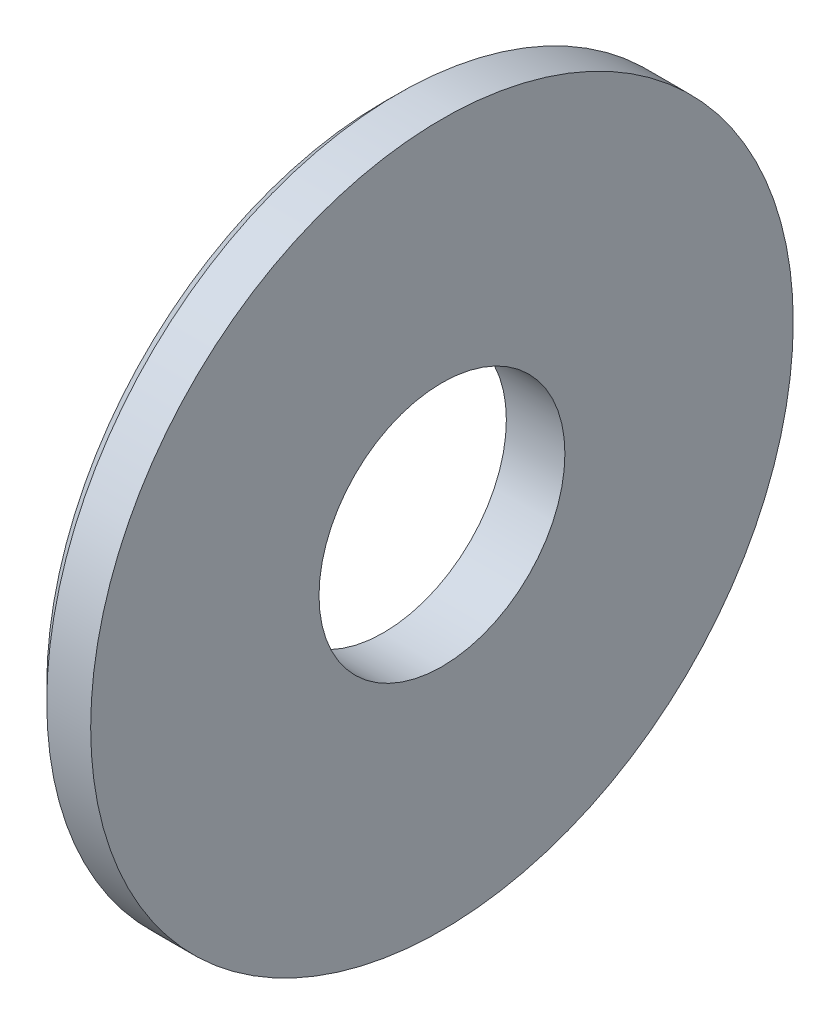
ISO-10303-21;
HEADER;
FILE_DESCRIPTION(('STEP AP214'),'2;1');
FILE_NAME('part.step','',(''),(''),'','','');
FILE_SCHEMA(('AUTOMOTIVE_DESIGN { 1 0 10303 214 1 1 1 1 }'));
ENDSEC;
DATA;
#1=APPLICATION_CONTEXT('core data for automotive mechanical design processes');
#2=APPLICATION_PROTOCOL_DEFINITION('international standard','automotive_design',2000,#1);
#3=PRODUCT_CONTEXT('',#1,'mechanical');
#4=PRODUCT('Part','Part','',(#3));
#5=PRODUCT_RELATED_PRODUCT_CATEGORY('part','',(#4));
#6=PRODUCT_DEFINITION_FORMATION('','',#4);
#7=PRODUCT_DEFINITION_CONTEXT('part definition',#1,'design');
#8=PRODUCT_DEFINITION('design','',#6,#7);
#9=PRODUCT_DEFINITION_SHAPE('','',#8);
#10=(LENGTH_UNIT() NAMED_UNIT(*) SI_UNIT(.MILLI.,.METRE.));
#11=(NAMED_UNIT(*) PLANE_ANGLE_UNIT() SI_UNIT($,.RADIAN.));
#12=(NAMED_UNIT(*) SI_UNIT($,.STERADIAN.) SOLID_ANGLE_UNIT());
#13=UNCERTAINTY_MEASURE_WITH_UNIT(LENGTH_MEASURE(1.E-05),#10,'distance_accuracy_value','');
#14=(GEOMETRIC_REPRESENTATION_CONTEXT(3) GLOBAL_UNCERTAINTY_ASSIGNED_CONTEXT((#13)) GLOBAL_UNIT_ASSIGNED_CONTEXT((#10,
#11,#12)) REPRESENTATION_CONTEXT('',''));
#15=CARTESIAN_POINT('',(0.,0.,0.));
#16=DIRECTION('',(0.,0.,1.));
#17=DIRECTION('',(1.,0.,0.));
#18=AXIS2_PLACEMENT_3D('',#15,#16,#17);
#19=CARTESIAN_POINT('',(2.,0.,0.));
#20=DIRECTION('',(-1.,0.,0.));
#21=DIRECTION('',(0.,0.,1.));
#22=AXIS2_PLACEMENT_3D('',#19,#20,#21);
#23=CYLINDRICAL_SURFACE('',#22,4.2);
#24=CARTESIAN_POINT('',(0.,0.,0.));
#25=DIRECTION('',(-1.,0.,0.));
#26=DIRECTION('',(0.,0.,1.));
#27=AXIS2_PLACEMENT_3D('',#24,#25,#26);
#28=CIRCLE('',#27,4.2);
#29=CARTESIAN_POINT('',(0.,0.,4.2));
#30=VERTEX_POINT('',#29);
#31=EDGE_CURVE('E43',#30,#30,#28,.T.);
#32=ORIENTED_EDGE('',*,*,#31,.T.);
#33=EDGE_LOOP('',(#32));
#34=FACE_BOUND('',#33,.T.);
#35=CARTESIAN_POINT('',(2.,0.,0.));
#36=DIRECTION('',(-1.,0.,0.));
#37=DIRECTION('',(0.,0.,1.));
#38=AXIS2_PLACEMENT_3D('',#35,#36,#37);
#39=CIRCLE('',#38,4.2);
#40=CARTESIAN_POINT('',(2.,0.,4.2));
#41=VERTEX_POINT('',#40);
#42=EDGE_CURVE('E52',#41,#41,#39,.T.);
#43=ORIENTED_EDGE('',*,*,#42,.F.);
#44=EDGE_LOOP('',(#43));
#45=FACE_BOUND('',#44,.T.);
#46=ADVANCED_FACE('F32',(#34,#45),#23,.F.);
#47=CARTESIAN_POINT('',(0.,4.2,0.));
#48=DIRECTION('',(-1.,0.,0.));
#49=DIRECTION('',(0.,0.,1.));
#50=AXIS2_PLACEMENT_3D('',#47,#48,#49);
#51=PLANE('',#50);
#52=CARTESIAN_POINT('',(0.,0.,0.));
#53=DIRECTION('',(-1.,0.,0.));
#54=DIRECTION('',(0.,0.,1.));
#55=AXIS2_PLACEMENT_3D('',#52,#53,#54);
#56=CIRCLE('',#55,11.5);
#57=CARTESIAN_POINT('',(0.,0.,11.5));
#58=VERTEX_POINT('',#57);
#59=EDGE_CURVE('E39',#58,#58,#56,.T.);
#60=ORIENTED_EDGE('',*,*,#59,.T.);
#61=EDGE_LOOP('',(#60));
#62=FACE_BOUND('',#61,.T.);
#63=ORIENTED_EDGE('',*,*,#31,.F.);
#64=EDGE_LOOP('',(#63));
#65=FACE_BOUND('',#64,.T.);
#66=ADVANCED_FACE('F60',(#62,#65),#51,.T.);
#67=CARTESIAN_POINT('',(2.,0.,0.));
#68=DIRECTION('',(-1.,0.,0.));
#69=DIRECTION('',(0.,0.,1.));
#70=AXIS2_PLACEMENT_3D('',#67,#68,#69);
#71=CYLINDRICAL_SURFACE('',#70,12.);
#72=CARTESIAN_POINT('',(0.500000000000006,0.,0.));
#73=DIRECTION('',(-1.,0.,0.));
#74=DIRECTION('',(0.,0.,1.));
#75=AXIS2_PLACEMENT_3D('',#72,#73,#74);
#76=CIRCLE('',#75,12.);
#77=CARTESIAN_POINT('',(0.500000000000006,0.,12.));
#78=VERTEX_POINT('',#77);
#79=EDGE_CURVE('E10',#78,#78,#76,.F.);
#80=ORIENTED_EDGE('',*,*,#79,.T.);
#81=EDGE_LOOP('',(#80));
#82=FACE_BOUND('',#81,.T.);
#83=CARTESIAN_POINT('',(2.,0.,0.));
#84=DIRECTION('',(-1.,0.,0.));
#85=DIRECTION('',(0.,0.,1.));
#86=AXIS2_PLACEMENT_3D('',#83,#84,#85);
#87=CIRCLE('',#86,12.);
#88=CARTESIAN_POINT('',(2.,0.,12.));
#89=VERTEX_POINT('',#88);
#90=EDGE_CURVE('E47',#89,#89,#87,.T.);
#91=ORIENTED_EDGE('',*,*,#90,.T.);
#92=EDGE_LOOP('',(#91));
#93=FACE_BOUND('',#92,.T.);
#94=ADVANCED_FACE('F65',(#82,#93),#71,.T.);
#95=CARTESIAN_POINT('',(2.,12.,0.));
#96=DIRECTION('',(1.,0.,0.));
#97=DIRECTION('',(0.,0.,-1.));
#98=AXIS2_PLACEMENT_3D('',#95,#96,#97);
#99=PLANE('',#98);
#100=ORIENTED_EDGE('',*,*,#42,.T.);
#101=EDGE_LOOP('',(#100));
#102=FACE_BOUND('',#101,.T.);
#103=ORIENTED_EDGE('',*,*,#90,.F.);
#104=EDGE_LOOP('',(#103));
#105=FACE_BOUND('',#104,.T.);
#106=ADVANCED_FACE('F56',(#102,#105),#99,.T.);
#107=CARTESIAN_POINT('',(0.,0.,0.));
#108=DIRECTION('',(1.,0.,0.));
#109=DIRECTION('',(0.,0.,-1.));
#110=AXIS2_PLACEMENT_3D('',#107,#108,#109);
#111=CONICAL_SURFACE('',#110,11.5,0.785398163397445);
#112=ORIENTED_EDGE('',*,*,#79,.F.);
#113=EDGE_LOOP('',(#112));
#114=FACE_BOUND('',#113,.T.);
#115=ORIENTED_EDGE('',*,*,#59,.F.);
#116=EDGE_LOOP('',(#115));
#117=FACE_BOUND('',#116,.T.);
#118=ADVANCED_FACE('F34',(#114,#117),#111,.T.);
#119=CLOSED_SHELL('',(#46,#66,#94,#106,#118));
#120=MANIFOLD_SOLID_BREP('B2',#119);
#121=ADVANCED_BREP_SHAPE_REPRESENTATION('',(#18,#120),#14);
#122=SHAPE_DEFINITION_REPRESENTATION(#9,#121);
ENDSEC;
END-ISO-10303-21;
